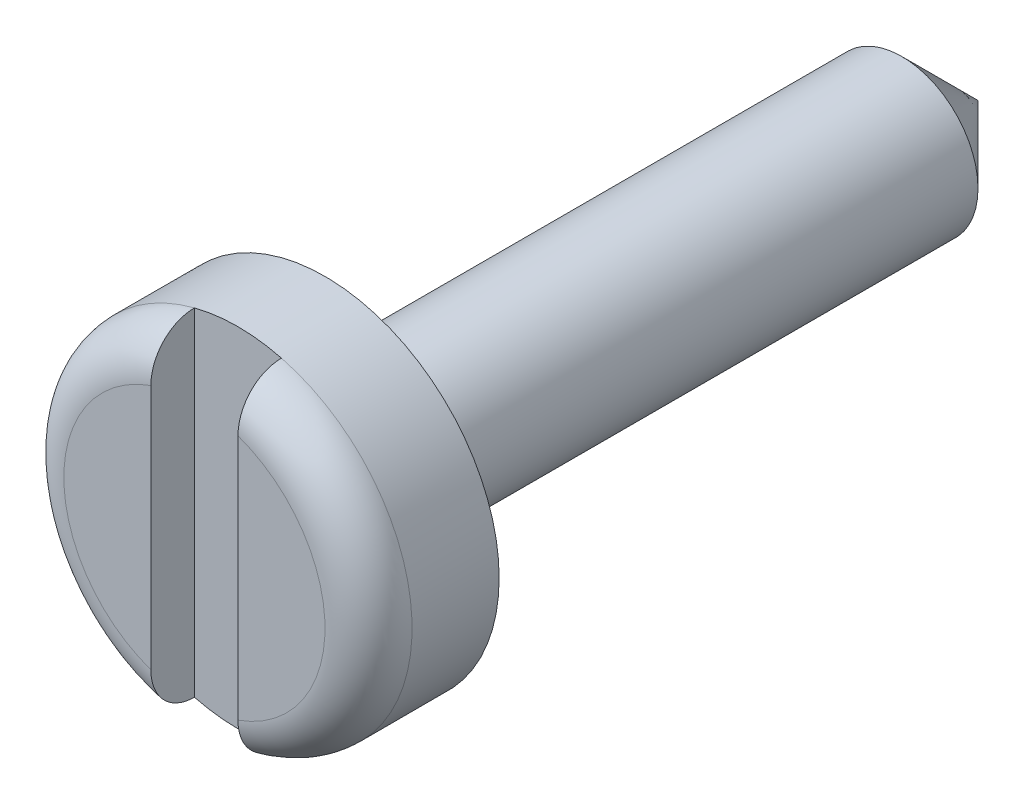
ISO-10303-21;
HEADER;
FILE_DESCRIPTION(('STEP AP214'),'2;1');
FILE_NAME('part.step','',(''),(''),'','','');
FILE_SCHEMA(('AUTOMOTIVE_DESIGN { 1 0 10303 214 1 1 1 1 }'));
ENDSEC;
DATA;
#1=APPLICATION_CONTEXT('core data for automotive mechanical design processes');
#2=APPLICATION_PROTOCOL_DEFINITION('international standard','automotive_design',2000,#1);
#3=PRODUCT_CONTEXT('',#1,'mechanical');
#4=PRODUCT('Part','Part','',(#3));
#5=PRODUCT_RELATED_PRODUCT_CATEGORY('part','',(#4));
#6=PRODUCT_DEFINITION_FORMATION('','',#4);
#7=PRODUCT_DEFINITION_CONTEXT('part definition',#1,'design');
#8=PRODUCT_DEFINITION('design','',#6,#7);
#9=PRODUCT_DEFINITION_SHAPE('','',#8);
#10=(LENGTH_UNIT() NAMED_UNIT(*) SI_UNIT(.MILLI.,.METRE.));
#11=(NAMED_UNIT(*) PLANE_ANGLE_UNIT() SI_UNIT($,.RADIAN.));
#12=(NAMED_UNIT(*) SI_UNIT($,.STERADIAN.) SOLID_ANGLE_UNIT());
#13=UNCERTAINTY_MEASURE_WITH_UNIT(LENGTH_MEASURE(1.E-05),#10,'distance_accuracy_value','');
#14=(GEOMETRIC_REPRESENTATION_CONTEXT(3) GLOBAL_UNCERTAINTY_ASSIGNED_CONTEXT((#13)) GLOBAL_UNIT_ASSIGNED_CONTEXT((#10,
#11,#12)) REPRESENTATION_CONTEXT('',''));
#15=CARTESIAN_POINT('',(0.,0.,0.));
#16=DIRECTION('',(0.,0.,1.));
#17=DIRECTION('',(1.,0.,0.));
#18=AXIS2_PLACEMENT_3D('',#15,#16,#17);
#19=CARTESIAN_POINT('',(0.,0.,18.));
#20=DIRECTION('',(0.,0.,1.));
#21=DIRECTION('',(1.,0.,0.));
#22=AXIS2_PLACEMENT_3D('',#19,#20,#21);
#23=PLANE('',#22);
#24=DIRECTION('',(0.,-1.,0.));
#25=VECTOR('',#24,1.);
#26=CARTESIAN_POINT('',(-0.999999999999999,-4.,18.));
#27=LINE('',#26,#25);
#28=CARTESIAN_POINT('',(-1.,2.82842712474619,18.));
#29=VERTEX_POINT('',#28);
#30=CARTESIAN_POINT('',(-0.999999999999999,-2.82842712474619,18.));
#31=VERTEX_POINT('',#30);
#32=EDGE_CURVE('E78',#29,#31,#27,.T.);
#33=ORIENTED_EDGE('',*,*,#32,.F.);
#34=CARTESIAN_POINT('',(0.,0.,18.));
#35=DIRECTION('',(0.,0.,1.));
#36=DIRECTION('',(1.,0.,0.));
#37=AXIS2_PLACEMENT_3D('',#34,#35,#36);
#38=CIRCLE('',#37,3.);
#39=EDGE_CURVE('E88',#29,#31,#38,.T.);
#40=ORIENTED_EDGE('',*,*,#39,.T.);
#41=EDGE_LOOP('',(#33,#40));
#42=FACE_BOUND('',#41,.T.);
#43=ADVANCED_FACE('F30',(#42),#23,.T.);
#44=CARTESIAN_POINT('',(0.,0.,17.));
#45=DIRECTION('',(0.,0.,1.));
#46=DIRECTION('',(1.,0.,0.));
#47=AXIS2_PLACEMENT_3D('',#44,#45,#46);
#48=TOROIDAL_SURFACE('',#47,3.,1.);
#49=CARTESIAN_POINT('',(-0.999999999999999,-3.79914959457453,17.3711969914726));
#50=CARTESIAN_POINT('',(-0.999999999999999,-3.81998294295055,17.3207923989405));
#51=CARTESIAN_POINT('',(-0.999999999999999,-3.83660721984707,17.2686059478065));
#52=CARTESIAN_POINT('',(-0.999999999999999,-3.86087413257949,17.1621410103618));
#53=CARTESIAN_POINT('',(-0.999999999999999,-3.86850690432784,17.1078602938152));
#54=CARTESIAN_POINT('',(-0.999999999999999,-3.87452042706844,16.9987973942731));
#55=CARTESIAN_POINT('',(-0.999999999999999,-3.87290356530891,16.9440153443111));
#56=CARTESIAN_POINT('',(-0.999999999999999,-3.8604744266951,16.835519711816));
#57=CARTESIAN_POINT('',(-0.999999999999999,-3.8496642316913,16.7818058901981));
#58=CARTESIAN_POINT('',(-0.999999999999999,-3.8192277744751,16.6770383462801));
#59=CARTESIAN_POINT('',(-0.999999999999999,-3.79961633484419,16.6259803119156));
#60=CARTESIAN_POINT('',(-0.999999999999999,-3.7522024617629,16.5278237653094));
#61=CARTESIAN_POINT('',(-0.999999999999999,-3.72439951497842,16.480725501451));
#62=CARTESIAN_POINT('',(-0.999999999999999,-3.66105922921123,16.3911585291803));
#63=CARTESIAN_POINT('',(-0.999999999999999,-3.62542844710418,16.348755964615));
#64=CARTESIAN_POINT('',(-0.999999999999999,-3.54772739260228,16.2703388747017));
#65=CARTESIAN_POINT('',(-0.999999999999999,-3.50565645180268,16.2343250132566));
#66=CARTESIAN_POINT('',(-0.999999999999999,-3.4150518282047,16.1686081922742));
#67=CARTESIAN_POINT('',(-0.999999999999999,-3.36637135567104,16.1391077831361));
#68=CARTESIAN_POINT('',(-0.999999999999999,-3.26489913513187,16.0883367981301));
#69=CARTESIAN_POINT('',(-0.999999999999999,-3.21210670748816,16.0670675862252));
#70=CARTESIAN_POINT('',(-0.999999999999999,-3.10163779105818,16.0324200422858));
#71=CARTESIAN_POINT('',(-0.999999999999999,-3.04385005559938,16.0193967337237));
#72=CARTESIAN_POINT('',(-0.999999999999999,-2.92693968790908,16.0027560538338));
#73=CARTESIAN_POINT('',(-0.999999999999999,-2.8678167541855,15.9991408287412));
#74=CARTESIAN_POINT('',(-0.999999999999999,-2.74690849184467,16.0012515403898));
#75=CARTESIAN_POINT('',(-0.999999999999999,-2.68513107106773,16.007432516475));
#76=CARTESIAN_POINT('',(-0.999999999999999,-2.56337279500385,16.0296499587614));
#77=CARTESIAN_POINT('',(-1.,-2.50339238568661,16.0456888505281));
#78=CARTESIAN_POINT('',(-1.,-2.38436557776264,16.0879751349425));
#79=CARTESIAN_POINT('',(-1.,-2.32545744896415,16.1146128182311));
#80=CARTESIAN_POINT('',(-1.,-2.21289008031951,16.1773617284805));
#81=CARTESIAN_POINT('',(-1.,-2.15923253362834,16.2134759976244));
#82=CARTESIAN_POINT('',(-1.,-2.05874239828965,16.2945164205208));
#83=CARTESIAN_POINT('',(-1.,-2.01193078611759,16.3394687073677));
#84=CARTESIAN_POINT('',(-1.,-1.92723302888673,16.4371496014948));
#85=CARTESIAN_POINT('',(-1.,-1.88934302543509,16.489874831052));
#86=CARTESIAN_POINT('',(-1.,-1.82699847940129,16.5975463275032));
#87=CARTESIAN_POINT('',(-1.,-1.80174997444422,16.6520301761496));
#88=CARTESIAN_POINT('',(-1.,-1.76233511250333,16.7648528256424));
#89=CARTESIAN_POINT('',(-1.,-1.74815338624965,16.8231861577917));
#90=CARTESIAN_POINT('',(-1.,-1.73302396386294,16.9338588534264));
#91=CARTESIAN_POINT('',(-1.,-1.7306041009875,16.9859997910389));
#92=CARTESIAN_POINT('',(-1.,-1.73515939673131,17.0898632325095));
#93=CARTESIAN_POINT('',(-1.,-1.74213238881455,17.1415858300929));
#94=CARTESIAN_POINT('',(-1.,-1.76432894493936,17.2400151699904));
#95=CARTESIAN_POINT('',(-1.,-1.77904571146589,17.286838300633));
#96=CARTESIAN_POINT('',(-1.,-1.81562382428371,17.3775933446972));
#97=CARTESIAN_POINT('',(-1.,-1.83748682784057,17.4215245846259));
#98=CARTESIAN_POINT('',(-1.,-1.88919389106912,17.5085949631864));
#99=CARTESIAN_POINT('',(-1.,-1.91948759605678,17.5514660613));
#100=CARTESIAN_POINT('',(-1.,-1.98610458522044,17.6322263263587));
#101=CARTESIAN_POINT('',(-1.,-2.02243055599435,17.6701132599649));
#102=CARTESIAN_POINT('',(-1.,-2.1048247970303,17.7446357000675));
#103=CARTESIAN_POINT('',(-1.,-2.15154084025896,17.7805559513651));
#104=CARTESIAN_POINT('',(-1.,-2.24993966121593,17.8447945102629));
#105=CARTESIAN_POINT('',(-1.,-2.30162461524338,17.8731094660844));
#106=CARTESIAN_POINT('',(-1.,-2.41332229099709,17.9236721711801));
#107=CARTESIAN_POINT('',(-0.999999999999999,-2.47366880403259,17.9451861540799));
#108=CARTESIAN_POINT('',(-0.999999999999999,-2.59709237312141,17.9779675648242));
#109=CARTESIAN_POINT('',(-0.999999999999999,-2.66016985051633,17.9892334056098));
#110=CARTESIAN_POINT('',(-0.999999999999999,-2.78835254479825,18.0011394739244));
#111=CARTESIAN_POINT('',(-0.999999999999999,-2.85347405724569,18.0016072205283));
#112=CARTESIAN_POINT('',(-0.999999999999999,-2.98281061319062,17.9912007987754));
#113=CARTESIAN_POINT('',(-0.999999999999999,-3.04702582829685,17.980328807629));
#114=CARTESIAN_POINT('',(-0.999999999999999,-3.17034097366743,17.9478584644544));
#115=CARTESIAN_POINT('',(-0.999999999999999,-3.2295407788564,17.9266403219763));
#116=CARTESIAN_POINT('',(-0.999999999999999,-3.34327047607657,17.874046577622));
#117=CARTESIAN_POINT('',(-0.999999999999999,-3.39780039053312,17.8426710245263));
#118=CARTESIAN_POINT('',(-0.999999999999999,-3.49774523912017,17.7723340791258));
#119=CARTESIAN_POINT('',(-0.999999999999999,-3.54347652862891,17.7338215620802));
#120=CARTESIAN_POINT('',(-0.999999999999999,-3.62740050120647,17.649379689505));
#121=CARTESIAN_POINT('',(-0.999999999999999,-3.66560540644395,17.6034625826476));
#122=CARTESIAN_POINT('',(-0.999999999999999,-3.71918689568898,17.5258544534201));
#123=CARTESIAN_POINT('',(-0.999999999999999,-3.73747134814742,17.4961300093788));
#124=CARTESIAN_POINT('',(-0.999999999999999,-3.77079370804452,17.4349120726421));
#125=CARTESIAN_POINT('',(-0.999999999999999,-3.78583167590185,17.4034186128826));
#126=CARTESIAN_POINT('',(-0.999999999999999,-3.79914959457453,17.3711969914726));
#127=B_SPLINE_CURVE_WITH_KNOTS('',3,(#49,#50,#51,#52,#53,#54,#55,#56,#57,#58,#59,#60,#61,#62,
#63,#64,#65,#66,#67,#68,#69,#70,#71,#72,#73,#74,#75,#76,#77,#78,#79,#80,#81,#82,#83,#84,#85,#86,
#87,#88,#89,#90,#91,#92,#93,#94,#95,#96,#97,#98,#99,#100,#101,#102,#103,#104,#105,#106,#107,
#108,#109,#110,#111,#112,#113,#114,#115,#116,#117,#118,#119,#120,#121,#122,#123,#124,#125,#126),
.UNSPECIFIED.,.T.,.F.,(4,2,2,2,2,2,2,2,2,2,2,2,2,2,2,2,2,2,2,2,2,2,2,2,2,2,2,2,2,2,2,2,2,2,2,2,
2,2,4),(0.,0.163494641308022,0.327168477087153,0.490800072009848,0.654394622062948,
0.817714682958768,0.981044980749127,1.14644261852602,1.31185743408098,1.48185633776403,
1.65188339932468,1.8288063892287,2.00576973645886,2.19119689332839,2.37666969329887,
2.56971984587854,2.76283204758875,2.9565240907278,3.15013221197125,3.32923385316812,
3.50808631754894,3.66384860010486,3.81957496101449,3.96618659387575,4.11283225121801,
4.26968657579983,4.42661094707999,4.60266022708795,4.77878696807112,4.97010195594656,
5.161446566411,5.35584549817514,5.55020711254221,5.73791051722989,5.92561302049316,
6.10408578326489,6.28226628904271,6.3867837590116,6.49129928369157),.UNSPECIFIED.);
#128=CARTESIAN_POINT('',(-0.999999999999999,-3.87298334620742,17.));
#129=VERTEX_POINT('',#128);
#130=EDGE_CURVE('E11',#31,#129,#127,.T.);
#131=ORIENTED_EDGE('',*,*,#130,.F.);
#132=ORIENTED_EDGE('',*,*,#39,.F.);
#133=CARTESIAN_POINT('',(-1.,1.75246231982762,17.1873286226625));
#134=CARTESIAN_POINT('',(-1.,1.74182018661854,17.1388468973742));
#135=CARTESIAN_POINT('',(-1.,1.73525182310481,17.0894435221706));
#136=CARTESIAN_POINT('',(-1.,1.73068256829864,16.990223439694));
#137=CARTESIAN_POINT('',(-1.,1.73268567552706,16.9404065503371));
#138=CARTESIAN_POINT('',(-1.,1.74512822320699,16.8419170360726));
#139=CARTESIAN_POINT('',(-1.,1.7555560754412,16.7932429338394));
#140=CARTESIAN_POINT('',(-1.,1.78422936271109,16.6982673878511));
#141=CARTESIAN_POINT('',(-1.,1.80247671280569,16.6519665284348));
#142=CARTESIAN_POINT('',(-1.,1.84647544653468,16.5615908241256));
#143=CARTESIAN_POINT('',(-1.,1.87241130206877,16.5176063622501));
#144=CARTESIAN_POINT('',(-1.,1.93054775495237,16.4340078905498));
#145=CARTESIAN_POINT('',(-1.,1.96275048503187,16.3943953757896));
#146=CARTESIAN_POINT('',(-1.,2.03655661265223,16.3157329871223));
#147=CARTESIAN_POINT('',(-1.,2.07882133344348,16.2773034780541));
#148=CARTESIAN_POINT('',(-1.,2.16867975991245,16.2072804385423));
#149=CARTESIAN_POINT('',(-1.,2.21627605581404,16.1756902528758));
#150=CARTESIAN_POINT('',(-1.,2.3207028734069,16.1170395318295));
#151=CARTESIAN_POINT('',(-1.,2.37798003096881,16.0907711277309));
#152=CARTESIAN_POINT('',(-1.,2.49603609643897,16.0478421049194));
#153=CARTESIAN_POINT('',(-1.,2.55681585329949,16.0311838263516));
#154=CARTESIAN_POINT('',(-1.,2.68244867817368,16.0076032778237));
#155=CARTESIAN_POINT('',(-1.,2.74736988308022,16.0010405141021));
#156=CARTESIAN_POINT('',(-1.,2.8773820639232,15.9991883666867));
#157=CARTESIAN_POINT('',(-1.,2.94247302579137,16.0038980767173));
#158=CARTESIAN_POINT('',(-1.,3.06926878299602,16.0244755270311));
#159=CARTESIAN_POINT('',(-1.,3.13101737384984,16.0400718787732));
#160=CARTESIAN_POINT('',(-1.,3.25079070817359,16.0819376229441));
#161=CARTESIAN_POINT('',(-1.,3.30881644300612,16.1082041602258));
#162=CARTESIAN_POINT('',(-1.,3.41648366961636,16.1693064114365));
#163=CARTESIAN_POINT('',(-1.,3.4663947284619,16.2036670539515));
#164=CARTESIAN_POINT('',(-1.,3.55937192037514,16.2806595563009));
#165=CARTESIAN_POINT('',(-1.,3.60243997681419,16.3232890844813));
#166=CARTESIAN_POINT('',(-1.,3.67839841139734,16.4134441771415));
#167=CARTESIAN_POINT('',(-1.,3.71166929843146,16.4606493676304));
#168=CARTESIAN_POINT('',(-1.,3.76948854403889,16.5601303478662));
#169=CARTESIAN_POINT('',(-1.,3.79403874776843,16.6124050620001));
#170=CARTESIAN_POINT('',(-1.,3.83289943591985,16.7186367169482));
#171=CARTESIAN_POINT('',(-1.,3.84752632873966,16.7724780765286));
#172=CARTESIAN_POINT('',(-1.,3.86735389467611,16.8818682266441));
#173=CARTESIAN_POINT('',(-1.,3.87255571406482,16.9374168087119));
#174=CARTESIAN_POINT('',(-1.,3.87335330605546,17.0476071741614));
#175=CARTESIAN_POINT('',(-1.,3.86911542191759,17.1022478334075));
#176=CARTESIAN_POINT('',(-1.,3.85151343562136,17.2100360011599));
#177=CARTESIAN_POINT('',(-1.,3.83814965450224,17.2631835621232));
#178=CARTESIAN_POINT('',(-1.,3.80274536962391,17.3664392897838));
#179=CARTESIAN_POINT('',(-1.,3.78071385999486,17.4165505451214));
#180=CARTESIAN_POINT('',(-1.,3.72866867326906,17.5124356962905));
#181=CARTESIAN_POINT('',(-1.,3.69865464319913,17.5582094002016));
#182=CARTESIAN_POINT('',(-1.,3.63105988842726,17.6448802813081));
#183=CARTESIAN_POINT('',(-1.,3.5933731753435,17.6856947220254));
#184=CARTESIAN_POINT('',(-1.,3.51185890692248,17.7606361844269));
#185=CARTESIAN_POINT('',(-1.,3.46803066395535,17.7947624562497));
#186=CARTESIAN_POINT('',(-1.,3.37411225852776,17.8564746844382));
#187=CARTESIAN_POINT('',(-1.,3.32387472920816,17.8838361778487));
#188=CARTESIAN_POINT('',(-1.,3.21965778152394,17.9301204299492));
#189=CARTESIAN_POINT('',(-1.,3.16567768917955,17.9490416640899));
#190=CARTESIAN_POINT('',(-1.,3.05309794318415,17.9787758674216));
#191=CARTESIAN_POINT('',(-1.,2.99439948438141,17.9892143869235));
#192=CARTESIAN_POINT('',(-1.,2.87609250557018,18.0005758721495));
#193=CARTESIAN_POINT('',(-1.,2.81648378069015,18.0014966631612));
#194=CARTESIAN_POINT('',(-1.,2.69500682113699,17.9938176523004));
#195=CARTESIAN_POINT('',(-1.,2.63316755099645,17.9847585116365));
#196=CARTESIAN_POINT('',(-1.,2.5117579447685,17.9567840925712));
#197=CARTESIAN_POINT('',(-1.,2.45218811604837,17.9378666239101));
#198=CARTESIAN_POINT('',(-1.,2.33467306586609,17.8898249795331));
#199=CARTESIAN_POINT('',(-1.,2.27687371604037,17.860342958555));
#200=CARTESIAN_POINT('',(-1.,2.16702316705835,17.792035456048));
#201=CARTESIAN_POINT('',(-1.,2.11497537447651,17.7532044800692));
#202=CARTESIAN_POINT('',(-1.,2.01868827204716,17.667272241699));
#203=CARTESIAN_POINT('',(-1.,1.97440937319098,17.6202155032961));
#204=CARTESIAN_POINT('',(-1.,1.89532665629936,17.5187795396541));
#205=CARTESIAN_POINT('',(-1.,1.86050178591108,17.4644169937839));
#206=CARTESIAN_POINT('',(-1.,1.81373840044919,17.372364921789));
#207=CARTESIAN_POINT('',(-1.,1.79817812360772,17.3364834856164));
#208=CARTESIAN_POINT('',(-1.,1.77172637197759,17.2630341080662));
#209=CARTESIAN_POINT('',(-1.,1.76083390052062,17.2254665286078));
#210=CARTESIAN_POINT('',(-1.,1.75246231982762,17.1873286226625));
#211=B_SPLINE_CURVE_WITH_KNOTS('',3,(#133,#134,#135,#136,#137,#138,#139,#140,#141,#142,#143,
#144,#145,#146,#147,#148,#149,#150,#151,#152,#153,#154,#155,#156,#157,#158,#159,#160,#161,#162,
#163,#164,#165,#166,#167,#168,#169,#170,#171,#172,#173,#174,#175,#176,#177,#178,#179,#180,#181,
#182,#183,#184,#185,#186,#187,#188,#189,#190,#191,#192,#193,#194,#195,#196,#197,#198,#199,#200,
#201,#202,#203,#204,#205,#206,#207,#208,#209,#210),.UNSPECIFIED.,.T.,.F.,(4,2,2,2,2,2,2,2,2,2,2,
2,2,2,2,2,2,2,2,2,2,2,2,2,2,2,2,2,2,2,2,2,2,2,2,2,2,2,4),(0.,0.148766404305182,
0.297602214482366,0.446233649190446,0.594901505773459,0.747473360403421,0.900097229064182,
1.07076776806481,1.2415215860364,1.42971473243578,1.61795368610444,1.81275232654433,
2.00753530624261,2.19762838632453,2.38767063443451,2.56853549764317,2.74934943466256,
2.9217446581083,3.09410338374215,3.26066945105429,3.427215259336,3.59084951146458,
3.75447800741267,3.91793715902243,4.08140353971397,4.24730331682047,4.41322168358336,
4.58407001687708,4.75494919772532,4.933014562933,5.11112061352099,5.29777999598343,
5.48448086691743,5.67821907671446,5.87207142702718,6.06490527723834,6.25730613306999,
6.37435748382942,6.49138382935423),.UNSPECIFIED.);
#212=CARTESIAN_POINT('',(-1.,3.87298334620742,17.));
#213=VERTEX_POINT('',#212);
#214=EDGE_CURVE('E42',#213,#29,#211,.T.);
#215=ORIENTED_EDGE('',*,*,#214,.F.);
#216=CARTESIAN_POINT('',(0.,0.,17.));
#217=DIRECTION('',(0.,0.,1.));
#218=DIRECTION('',(1.,0.,0.));
#219=AXIS2_PLACEMENT_3D('',#216,#217,#218);
#220=CIRCLE('',#219,4.);
#221=EDGE_CURVE('E103',#129,#213,#220,.F.);
#222=ORIENTED_EDGE('',*,*,#221,.F.);
#223=EDGE_LOOP('',(#131,#132,#215,#222));
#224=FACE_BOUND('',#223,.T.);
#225=ADVANCED_FACE('F91',(#224),#48,.T.);
#226=CARTESIAN_POINT('',(0.,0.,15.));
#227=DIRECTION('',(0.,0.,-1.));
#228=DIRECTION('',(-1.,0.,0.));
#229=AXIS2_PLACEMENT_3D('',#226,#227,#228);
#230=CYLINDRICAL_SURFACE('',#229,1.75);
#231=CARTESIAN_POINT('',(0.,0.,1.75));
#232=DIRECTION('',(0.,0.,1.));
#233=DIRECTION('',(1.,0.,0.));
#234=AXIS2_PLACEMENT_3D('',#231,#232,#233);
#235=CIRCLE('',#234,1.75);
#236=CARTESIAN_POINT('',(1.75,0.,1.75));
#237=VERTEX_POINT('',#236);
#238=EDGE_CURVE('E102',#237,#237,#235,.T.);
#239=ORIENTED_EDGE('',*,*,#238,.T.);
#240=EDGE_LOOP('',(#239));
#241=FACE_BOUND('',#240,.T.);
#242=CARTESIAN_POINT('',(0.,0.,15.));
#243=DIRECTION('',(0.,0.,1.));
#244=DIRECTION('',(1.,0.,0.));
#245=AXIS2_PLACEMENT_3D('',#242,#243,#244);
#246=CIRCLE('',#245,1.75);
#247=CARTESIAN_POINT('',(1.75,0.,15.));
#248=VERTEX_POINT('',#247);
#249=EDGE_CURVE('E98',#248,#248,#246,.T.);
#250=ORIENTED_EDGE('',*,*,#249,.F.);
#251=EDGE_LOOP('',(#250));
#252=FACE_BOUND('',#251,.T.);
#253=ADVANCED_FACE('F32',(#241,#252),#230,.T.);
#254=CARTESIAN_POINT('',(0.,0.,15.));
#255=DIRECTION('',(0.,0.,1.));
#256=DIRECTION('',(1.,0.,0.));
#257=AXIS2_PLACEMENT_3D('',#254,#255,#256);
#258=PLANE('',#257);
#259=CARTESIAN_POINT('',(0.,0.,15.));
#260=DIRECTION('',(0.,0.,1.));
#261=DIRECTION('',(1.,0.,0.));
#262=AXIS2_PLACEMENT_3D('',#259,#260,#261);
#263=CIRCLE('',#262,4.);
#264=CARTESIAN_POINT('',(4.,0.,15.));
#265=VERTEX_POINT('',#264);
#266=EDGE_CURVE('E159',#265,#265,#263,.T.);
#267=ORIENTED_EDGE('',*,*,#266,.F.);
#268=EDGE_LOOP('',(#267));
#269=FACE_BOUND('',#268,.T.);
#270=ORIENTED_EDGE('',*,*,#249,.T.);
#271=EDGE_LOOP('',(#270));
#272=FACE_BOUND('',#271,.T.);
#273=ADVANCED_FACE('F148',(#269,#272),#258,.F.);
#274=CARTESIAN_POINT('',(0.,0.,18.));
#275=DIRECTION('',(0.,0.,-1.));
#276=DIRECTION('',(-1.,0.,0.));
#277=AXIS2_PLACEMENT_3D('',#274,#275,#276);
#278=CYLINDRICAL_SURFACE('',#277,4.);
#279=CARTESIAN_POINT('',(0.999999999999999,-3.87298334620742,17.));
#280=VERTEX_POINT('',#279);
#281=EDGE_CURVE('E96',#280,#129,#220,.F.);
#282=ORIENTED_EDGE('',*,*,#281,.T.);
#283=ORIENTED_EDGE('',*,*,#221,.T.);
#284=CARTESIAN_POINT('',(0.999999999999998,3.87298334620742,17.));
#285=VERTEX_POINT('',#284);
#286=EDGE_CURVE('E52',#213,#285,#220,.F.);
#287=ORIENTED_EDGE('',*,*,#286,.T.);
#288=EDGE_CURVE('E92',#285,#280,#220,.F.);
#289=ORIENTED_EDGE('',*,*,#288,.T.);
#290=EDGE_LOOP('',(#282,#283,#287,#289));
#291=FACE_BOUND('',#290,.T.);
#292=ORIENTED_EDGE('',*,*,#266,.T.);
#293=EDGE_LOOP('',(#292));
#294=FACE_BOUND('',#293,.T.);
#295=ADVANCED_FACE('F143',(#291,#294),#278,.T.);
#296=DIRECTION('',(0.,1.,0.));
#297=VECTOR('',#296,1.);
#298=CARTESIAN_POINT('',(0.999999999999999,-4.,18.));
#299=LINE('',#298,#297);
#300=CARTESIAN_POINT('',(0.999999999999999,-2.82842712474619,18.));
#301=VERTEX_POINT('',#300);
#302=CARTESIAN_POINT('',(0.999999999999999,2.82842712474619,18.));
#303=VERTEX_POINT('',#302);
#304=EDGE_CURVE('E89',#301,#303,#299,.T.);
#305=ORIENTED_EDGE('',*,*,#304,.F.);
#306=EDGE_CURVE('E93',#301,#303,#38,.T.);
#307=ORIENTED_EDGE('',*,*,#306,.T.);
#308=EDGE_LOOP('',(#305,#307));
#309=FACE_BOUND('',#308,.T.);
#310=ADVANCED_FACE('F134',(#309),#23,.T.);
#311=CARTESIAN_POINT('',(0.999999999999999,-3.79914959457453,17.3711969914726));
#312=CARTESIAN_POINT('',(0.999999999999999,-3.7777158170893,17.4230398933796));
#313=CARTESIAN_POINT('',(0.999999999999999,-3.75179272490852,17.473082105849));
#314=CARTESIAN_POINT('',(0.999999999999999,-3.69181645706017,17.5680968151433));
#315=CARTESIAN_POINT('',(0.999999999999999,-3.65775064031584,17.6130612676433));
#316=CARTESIAN_POINT('',(0.999999999999999,-3.58265718974507,17.6965921347092));
#317=CARTESIAN_POINT('',(0.999999999999999,-3.54164226962844,17.7351699834875));
#318=CARTESIAN_POINT('',(0.999999999999999,-3.45387110510903,17.8050717429757));
#319=CARTESIAN_POINT('',(0.999999999999999,-3.40711637837637,17.8363975649094));
#320=CARTESIAN_POINT('',(0.999999999999999,-3.30798965511939,17.8918179008064));
#321=CARTESIAN_POINT('',(0.999999999999999,-3.25550781795579,17.9157156999461));
#322=CARTESIAN_POINT('',(0.999999999999999,-3.14739175323052,17.9547791252966));
#323=CARTESIAN_POINT('',(0.999999999999999,-3.09175679405832,17.9699427157459));
#324=CARTESIAN_POINT('',(0.999999999999999,-2.97629847974027,17.9918331744663));
#325=CARTESIAN_POINT('',(0.999999999999999,-2.91639874366935,17.9981567760536));
#326=CARTESIAN_POINT('',(0.999999999999999,-2.79636135828955,18.0011477994282));
#327=CARTESIAN_POINT('',(0.999999999999999,-2.73622365573792,17.9978129221164));
#328=CARTESIAN_POINT('',(0.999999999999999,-2.61437717893913,17.9813695270309));
#329=CARTESIAN_POINT('',(0.999999999999999,-2.55273009410503,17.9678028513548));
#330=CARTESIAN_POINT('',(0.999999999999999,-2.43244598125983,17.9308458838554));
#331=CARTESIAN_POINT('',(0.999999999999999,-2.37380975411183,17.9074529933758));
#332=CARTESIAN_POINT('',(0.999999999999999,-2.25931585500127,17.8505554647649));
#333=CARTESIAN_POINT('',(0.999999999999999,-2.20360551436859,17.816753355868));
#334=CARTESIAN_POINT('',(0.999999999999999,-2.09876538299612,17.7400864576204));
#335=CARTESIAN_POINT('',(0.999999999999999,-2.04963717939975,17.6972194888719));
#336=CARTESIAN_POINT('',(0.999999999999999,-1.96080785060438,17.6043568104292));
#337=CARTESIAN_POINT('',(0.999999999999999,-1.92092667034593,17.5545342849891));
#338=CARTESIAN_POINT('',(0.999999999999999,-1.85124038915424,17.448271108109));
#339=CARTESIAN_POINT('',(0.999999999999999,-1.82142527900841,17.3918371064831));
#340=CARTESIAN_POINT('',(0.999999999999999,-1.77631855424286,17.2802047949701));
#341=CARTESIAN_POINT('',(0.999999999999999,-1.75983891307553,17.2254884431255));
#342=CARTESIAN_POINT('',(0.999999999999999,-1.7377207535467,17.1139219855492));
#343=CARTESIAN_POINT('',(0.999999999999999,-1.73207064478508,17.0570742275091));
#344=CARTESIAN_POINT('',(0.999999999999999,-1.73203339861811,16.9501849748106));
#345=CARTESIAN_POINT('',(0.999999999999999,-1.73638437650009,16.9001396436901));
#346=CARTESIAN_POINT('',(0.999999999999999,-1.75353136919575,16.801523467781));
#347=CARTESIAN_POINT('',(0.999999999999999,-1.76632782700338,16.752952700478));
#348=CARTESIAN_POINT('',(0.999999999999999,-1.79947780164141,16.6590297168198));
#349=CARTESIAN_POINT('',(0.999999999999999,-1.81975568154382,16.6136505222585));
#350=CARTESIAN_POINT('',(0.999999999999999,-1.86696072103072,16.5265068953999));
#351=CARTESIAN_POINT('',(0.999999999999999,-1.89388990133816,16.4847435668513));
#352=CARTESIAN_POINT('',(0.999999999999999,-1.95643927885508,16.4015334005932));
#353=CARTESIAN_POINT('',(0.999999999999999,-1.99266050287613,16.3605390524519));
#354=CARTESIAN_POINT('',(0.999999999999999,-2.07081216136128,16.2844152051139));
#355=CARTESIAN_POINT('',(0.999999999999999,-2.1127453729375,16.2492885773546));
#356=CARTESIAN_POINT('',(0.999999999999999,-2.20641842435671,16.1816980928147));
#357=CARTESIAN_POINT('',(0.999999999999999,-2.25873161590645,16.1500267466256));
#358=CARTESIAN_POINT('',(0.999999999999999,-2.36769762460114,16.0953143005733));
#359=CARTESIAN_POINT('',(0.999999999999999,-2.42435197328782,16.0722762635469));
#360=CARTESIAN_POINT('',(0.999999999999999,-2.54415894981401,16.0342614764375));
#361=CARTESIAN_POINT('',(0.999999999999999,-2.60749703565932,16.0198653806666));
#362=CARTESIAN_POINT('',(0.999999999999999,-2.73570379606242,16.001974317784));
#363=CARTESIAN_POINT('',(0.999999999999999,-2.80057251782717,15.9984796873327));
#364=CARTESIAN_POINT('',(0.999999999999999,-2.92955012220835,16.0027152743951));
#365=CARTESIAN_POINT('',(0.999999999999999,-2.99366121944869,16.0103753785125));
#366=CARTESIAN_POINT('',(0.999999999999999,-3.11954564631437,16.036849489152));
#367=CARTESIAN_POINT('',(0.999999999999999,-3.18131948716749,16.0556610413391));
#368=CARTESIAN_POINT('',(0.999999999999999,-3.29788245549673,16.1030716393127));
#369=CARTESIAN_POINT('',(0.999999999999999,-3.3528582389706,16.1312113580087));
#370=CARTESIAN_POINT('',(0.999999999999999,-3.45696571812231,16.1967784562546));
#371=CARTESIAN_POINT('',(0.999999999999999,-3.50609910054331,16.234203145489));
#372=CARTESIAN_POINT('',(0.999999999999999,-3.59456210584203,16.3152736065412));
#373=CARTESIAN_POINT('',(0.999999999999999,-3.6342548011155,16.358523383113));
#374=CARTESIAN_POINT('',(0.999999999999999,-3.70545606395973,16.4513025161115));
#375=CARTESIAN_POINT('',(0.999999999999999,-3.73696698123992,16.5008300635426));
#376=CARTESIAN_POINT('',(0.999999999999999,-3.78965172147008,16.6026547866928));
#377=CARTESIAN_POINT('',(0.999999999999999,-3.81118147613364,16.6547680145616));
#378=CARTESIAN_POINT('',(0.999999999999999,-3.84495334343748,16.7619395981222));
#379=CARTESIAN_POINT('',(0.999999999999999,-3.85719418919283,16.8169983544495));
#380=CARTESIAN_POINT('',(0.999999999999999,-3.87179556205647,16.9271144116675));
#381=CARTESIAN_POINT('',(0.999999999999999,-3.87437634177227,16.9821427608536));
#382=CARTESIAN_POINT('',(0.999999999999999,-3.87017864623861,17.0917871210148));
#383=CARTESIAN_POINT('',(0.999999999999999,-3.8634138254116,17.1464036165817));
#384=CARTESIAN_POINT('',(0.999999999999999,-3.84593823021617,17.2292858324567));
#385=CARTESIAN_POINT('',(0.999999999999999,-3.8384125986029,17.2582589867351));
#386=CARTESIAN_POINT('',(0.999999999999999,-3.82073337831642,17.3153911124946));
#387=CARTESIAN_POINT('',(0.999999999999999,-3.81057984405194,17.343550100819));
#388=CARTESIAN_POINT('',(0.999999999999999,-3.79914959457453,17.3711969914726));
#389=B_SPLINE_CURVE_WITH_KNOTS('',3,(#311,#312,#313,#314,#315,#316,#317,#318,#319,#320,#321,
#322,#323,#324,#325,#326,#327,#328,#329,#330,#331,#332,#333,#334,#335,#336,#337,#338,#339,#340,
#341,#342,#343,#344,#345,#346,#347,#348,#349,#350,#351,#352,#353,#354,#355,#356,#357,#358,#359,
#360,#361,#362,#363,#364,#365,#366,#367,#368,#369,#370,#371,#372,#373,#374,#375,#376,#377,#378,
#379,#380,#381,#382,#383,#384,#385,#386,#387,#388),.UNSPECIFIED.,.T.,.F.,(4,2,2,2,2,2,2,2,2,2,2,
2,2,2,2,2,2,2,2,2,2,2,2,2,2,2,2,2,2,2,2,2,2,2,2,2,2,2,4),(0.,0.16818340566852,0.336629621103954,
0.504770919935273,0.672867855665851,0.845097437206753,1.01736714563842,1.19726420097509,
1.37720408243251,1.56571840082893,1.7542826054393,1.94883381695895,2.14343185628995,
2.33384384579697,2.52406593733568,2.69450348568673,2.86475851970715,3.01472569712253,
3.16470074144799,3.31319933143997,3.46174309220925,3.62519608598723,3.7887288345496,
3.97139668754267,4.15412928434592,4.34806217433096,4.54200105331606,4.73472617335804,
4.92740889204716,5.11174407746891,5.29602591411566,5.47125362376385,5.64643095429509,
5.81476050812301,5.98311301576276,6.14760279848509,6.31185250683521,6.40154356036495,
6.49123275705811),.UNSPECIFIED.);
#390=EDGE_CURVE('E85',#280,#301,#389,.T.);
#391=ORIENTED_EDGE('',*,*,#390,.F.);
#392=ORIENTED_EDGE('',*,*,#288,.F.);
#393=CARTESIAN_POINT('',(0.999999999999999,1.75246231982762,17.1873286226625));
#394=CARTESIAN_POINT('',(0.999999999999999,1.7641901145319,17.240722471863));
#395=CARTESIAN_POINT('',(0.999999999999999,1.78088431327125,17.2930917956184));
#396=CARTESIAN_POINT('',(0.999999999999999,1.8231657722519,17.3941769283564));
#397=CARTESIAN_POINT('',(0.999999999999999,1.84877536719394,17.4428831844843));
#398=CARTESIAN_POINT('',(0.999999999999999,1.90742230856642,17.5351830500301));
#399=CARTESIAN_POINT('',(0.999999999999999,1.94041699492321,17.5788039176082));
#400=CARTESIAN_POINT('',(0.999999999999999,2.01265549489701,17.6604567330821));
#401=CARTESIAN_POINT('',(0.999999999999999,2.05189750841483,17.6984902848505));
#402=CARTESIAN_POINT('',(0.999999999999999,2.13931821019164,17.7715962443691));
#403=CARTESIAN_POINT('',(0.999999999999999,2.18798499677384,17.8060851987966));
#404=CARTESIAN_POINT('',(0.999999999999999,2.29007454572705,17.8671252980939));
#405=CARTESIAN_POINT('',(0.999999999999999,2.34349947104471,17.8936728088081));
#406=CARTESIAN_POINT('',(0.999999999999999,2.45818528058034,17.940040528686));
#407=CARTESIAN_POINT('',(0.999999999999999,2.51973150293092,17.9591587698323));
#408=CARTESIAN_POINT('',(0.999999999999999,2.64515676082748,17.9868906750727));
#409=CARTESIAN_POINT('',(0.999999999999999,2.70903608759078,17.9955030231777));
#410=CARTESIAN_POINT('',(0.999999999999999,2.83783973855234,18.0018132960899));
#411=CARTESIAN_POINT('',(0.999999999999999,2.90276832082442,17.999426846781));
#412=CARTESIAN_POINT('',(0.999999999999999,3.03121688144897,17.9833427810629));
#413=CARTESIAN_POINT('',(0.999999999999998,3.09473712332596,17.9696472994249));
#414=CARTESIAN_POINT('',(0.999999999999998,3.21595761632668,17.9318157325655));
#415=CARTESIAN_POINT('',(0.999999999999998,3.27378717947107,17.9080947389903));
#416=CARTESIAN_POINT('',(0.999999999999998,3.38433620317705,17.8507840264958));
#417=CARTESIAN_POINT('',(0.999999999999998,3.43705711805034,17.8171971272084));
#418=CARTESIAN_POINT('',(0.999999999999998,3.53308975424381,17.7429253043387));
#419=CARTESIAN_POINT('',(0.999999999999998,3.57673922301766,17.7026769573388));
#420=CARTESIAN_POINT('',(0.999999999999998,3.65629203640244,17.6151378752509));
#421=CARTESIAN_POINT('',(0.999999999999998,3.69219739339051,17.5678489751259));
#422=CARTESIAN_POINT('',(0.999999999999998,3.75367461690347,17.4697401958816));
#423=CARTESIAN_POINT('',(0.999999999999998,3.77961800893732,17.419152914346));
#424=CARTESIAN_POINT('',(0.999999999999998,3.82236962079628,17.3142552173783));
#425=CARTESIAN_POINT('',(0.999999999999998,3.83917944620656,17.2599454582102));
#426=CARTESIAN_POINT('',(0.999999999999998,3.86276136768186,17.1507452923263));
#427=CARTESIAN_POINT('',(0.999999999999998,3.86979504536246,17.0959112448408));
#428=CARTESIAN_POINT('',(0.999999999999998,3.87444500196554,16.9858470964548));
#429=CARTESIAN_POINT('',(0.999999999999998,3.87206209279902,16.9306170301095));
#430=CARTESIAN_POINT('',(0.999999999999998,3.85803638822911,16.8219608764813));
#431=CARTESIAN_POINT('',(0.999999999999998,3.846494607709,16.7685217006864));
#432=CARTESIAN_POINT('',(0.999999999999998,3.81464927070628,16.6643247086616));
#433=CARTESIAN_POINT('',(0.999999999999998,3.79434573660114,16.6135668855839));
#434=CARTESIAN_POINT('',(0.999999999999998,3.7454855269319,16.5158527902323));
#435=CARTESIAN_POINT('',(0.999999999999998,3.71688473301031,16.4689186041151));
#436=CARTESIAN_POINT('',(0.999999999999998,3.65236126782503,16.3803927084875));
#437=CARTESIAN_POINT('',(0.999999999999998,3.6164380647968,16.3388013873419));
#438=CARTESIAN_POINT('',(0.999999999999998,3.5375186943358,16.2611754354768));
#439=CARTESIAN_POINT('',(0.999999999999998,3.49438989007716,16.2252757670835));
#440=CARTESIAN_POINT('',(0.999999999999998,3.40289091120234,16.1609405089602));
#441=CARTESIAN_POINT('',(0.999999999999998,3.35452000492958,16.1325059630612));
#442=CARTESIAN_POINT('',(0.999999999999998,3.25211799564129,16.0828136194977));
#443=CARTESIAN_POINT('',(0.999999999999998,3.19794785458122,16.061842589636));
#444=CARTESIAN_POINT('',(0.999999999999998,3.08695192125969,16.0288541623444));
#445=CARTESIAN_POINT('',(0.999999999999999,3.03012559977754,16.0168385573549));
#446=CARTESIAN_POINT('',(0.999999999999999,2.91267730184056,16.0015122274376));
#447=CARTESIAN_POINT('',(0.999999999999999,2.85200035953023,15.998623101704));
#448=CARTESIAN_POINT('',(0.999999999999999,2.73096739402222,16.0025886431983));
#449=CARTESIAN_POINT('',(0.999999999999999,2.67061145287216,16.0094456917225));
#450=CARTESIAN_POINT('',(0.999999999999999,2.54894914145261,16.0331089595771));
#451=CARTESIAN_POINT('',(0.999999999999999,2.48773003616597,16.0503648911398));
#452=CARTESIAN_POINT('',(0.999999999999999,2.36891769027413,16.0946424822268));
#453=CARTESIAN_POINT('',(0.999999999999999,2.31132548927023,16.1216669269328));
#454=CARTESIAN_POINT('',(0.999999999999999,2.1999572719527,16.1856351592191));
#455=CARTESIAN_POINT('',(0.999999999999999,2.14631577455243,16.2228140097847));
#456=CARTESIAN_POINT('',(0.999999999999999,2.04628516970338,16.3059542996619));
#457=CARTESIAN_POINT('',(0.999999999999999,1.99989663819564,16.3519164357902));
#458=CARTESIAN_POINT('',(0.999999999999999,1.91782306516257,16.4498220306175));
#459=CARTESIAN_POINT('',(0.999999999999999,1.88181454201629,16.5014927648511));
#460=CARTESIAN_POINT('',(0.999999999999999,1.82030634257845,16.6107744337744));
#461=CARTESIAN_POINT('',(0.999999999999999,1.79479726742314,16.6683799977202));
#462=CARTESIAN_POINT('',(0.999999999999999,1.75834010348052,16.7807413889589));
#463=CARTESIAN_POINT('',(0.999999999999999,1.74605556701119,16.8350639489775));
#464=CARTESIAN_POINT('',(0.999999999999999,1.7320468785716,16.9449868891655));
#465=CARTESIAN_POINT('',(0.999999999999999,1.73029705807762,17.0005838318116));
#466=CARTESIAN_POINT('',(0.999999999999999,1.73527068278324,17.0778868504808));
#467=CARTESIAN_POINT('',(0.999999999999999,1.7375478186893,17.0999521859254));
#468=CARTESIAN_POINT('',(0.999999999999999,1.7437652325328,17.1438440494316));
#469=CARTESIAN_POINT('',(0.999999999999999,1.7477052062694,17.165670620424));
#470=CARTESIAN_POINT('',(0.999999999999999,1.75246231982762,17.1873286226625));
#471=B_SPLINE_CURVE_WITH_KNOTS('',3,(#393,#394,#395,#396,#397,#398,#399,#400,#401,#402,#403,
#404,#405,#406,#407,#408,#409,#410,#411,#412,#413,#414,#415,#416,#417,#418,#419,#420,#421,#422,
#423,#424,#425,#426,#427,#428,#429,#430,#431,#432,#433,#434,#435,#436,#437,#438,#439,#440,#441,
#442,#443,#444,#445,#446,#447,#448,#449,#450,#451,#452,#453,#454,#455,#456,#457,#458,#459,#460,
#461,#462,#463,#464,#465,#466,#467,#468,#469,#470),.UNSPECIFIED.,.T.,.F.,(4,2,2,2,2,2,2,2,2,2,2,
2,2,2,2,2,2,2,2,2,2,2,2,2,2,2,2,2,2,2,2,2,2,2,2,2,2,2,4),(0.,0.163906685407303,
0.328226977604424,0.491621505818748,0.654969038610702,0.833165214763724,1.01144281256534,
1.20388306688739,1.39634742418431,1.59029066334137,1.78419730079751,1.97075959929137,
2.15726863090036,2.33449311840367,2.51167149689399,2.68138764609756,2.85107395132273,
3.01612633563605,3.18116448921747,3.34440728919034,3.50764967224434,3.67177647899198,
3.83591520912838,4.00349928056554,4.17110677243372,4.34459422276611,4.51811638753215,
4.69954535365351,4.88101865618892,5.07096755002403,5.26097064453427,5.45581197565728,
5.65066877082491,5.83855628827543,6.02627524542109,6.19242181099684,6.35816338523789,
6.42466056927461,6.49114559353494),.UNSPECIFIED.);
#472=EDGE_CURVE('E106',#303,#285,#471,.T.);
#473=ORIENTED_EDGE('',*,*,#472,.F.);
#474=ORIENTED_EDGE('',*,*,#306,.F.);
#475=EDGE_LOOP('',(#391,#392,#473,#474));
#476=FACE_BOUND('',#475,.T.);
#477=ADVANCED_FACE('F113',(#476),#48,.T.);
#478=CARTESIAN_POINT('',(0.,0.,1.75));
#479=DIRECTION('',(0.,0.,1.));
#480=DIRECTION('',(1.,0.,0.));
#481=AXIS2_PLACEMENT_3D('',#478,#479,#480);
#482=CONICAL_SURFACE('',#481,1.75000000000001,0.78539816339745);
#483=CARTESIAN_POINT('',(0.,0.,0.));
#484=VERTEX_POINT('',#483);
#485=VERTEX_LOOP('',#484);
#486=FACE_BOUND('',#485,.T.);
#487=ORIENTED_EDGE('',*,*,#238,.F.);
#488=EDGE_LOOP('',(#487));
#489=FACE_BOUND('',#488,.T.);
#490=ADVANCED_FACE('F126',(#486,#489),#482,.T.);
#491=CARTESIAN_POINT('',(-0.999999999999999,-4.,17.));
#492=DIRECTION('',(-1.,0.,0.));
#493=DIRECTION('',(0.,-1.,0.));
#494=AXIS2_PLACEMENT_3D('',#491,#492,#493);
#495=PLANE('',#494);
#496=ORIENTED_EDGE('',*,*,#130,.T.);
#497=DIRECTION('',(0.,-1.,0.));
#498=VECTOR('',#497,1.);
#499=CARTESIAN_POINT('',(-0.999999999999999,-4.,17.));
#500=LINE('',#499,#498);
#501=EDGE_CURVE('E81',#213,#129,#500,.T.);
#502=ORIENTED_EDGE('',*,*,#501,.F.);
#503=ORIENTED_EDGE('',*,*,#214,.T.);
#504=ORIENTED_EDGE('',*,*,#32,.T.);
#505=EDGE_LOOP('',(#496,#502,#503,#504));
#506=FACE_BOUND('',#505,.T.);
#507=ADVANCED_FACE('F77',(#506),#495,.F.);
#508=CARTESIAN_POINT('',(0.999999999999999,-4.,17.));
#509=DIRECTION('',(1.,0.,0.));
#510=DIRECTION('',(0.,1.,0.));
#511=AXIS2_PLACEMENT_3D('',#508,#509,#510);
#512=PLANE('',#511);
#513=ORIENTED_EDGE('',*,*,#390,.T.);
#514=ORIENTED_EDGE('',*,*,#304,.T.);
#515=ORIENTED_EDGE('',*,*,#472,.T.);
#516=DIRECTION('',(0.,1.,0.));
#517=VECTOR('',#516,1.);
#518=CARTESIAN_POINT('',(0.999999999999999,-4.,17.));
#519=LINE('',#518,#517);
#520=EDGE_CURVE('E157',#280,#285,#519,.T.);
#521=ORIENTED_EDGE('',*,*,#520,.F.);
#522=EDGE_LOOP('',(#513,#514,#515,#521));
#523=FACE_BOUND('',#522,.T.);
#524=ADVANCED_FACE('F117',(#523),#512,.F.);
#525=CARTESIAN_POINT('',(-1.,4.,17.));
#526=DIRECTION('',(0.,0.,-1.));
#527=DIRECTION('',(-1.,0.,0.));
#528=AXIS2_PLACEMENT_3D('',#525,#526,#527);
#529=PLANE('',#528);
#530=ORIENTED_EDGE('',*,*,#501,.T.);
#531=ORIENTED_EDGE('',*,*,#281,.F.);
#532=ORIENTED_EDGE('',*,*,#520,.T.);
#533=ORIENTED_EDGE('',*,*,#286,.F.);
#534=EDGE_LOOP('',(#530,#531,#532,#533));
#535=FACE_BOUND('',#534,.T.);
#536=ADVANCED_FACE('F121',(#535),#529,.F.);
#537=CLOSED_SHELL('',(#43,#225,#253,#273,#295,#310,#477,#490,#507,#524,#536));
#538=MANIFOLD_SOLID_BREP('B2',#537);
#539=ADVANCED_BREP_SHAPE_REPRESENTATION('',(#18,#538),#14);
#540=SHAPE_DEFINITION_REPRESENTATION(#9,#539);
ENDSEC;
END-ISO-10303-21;
